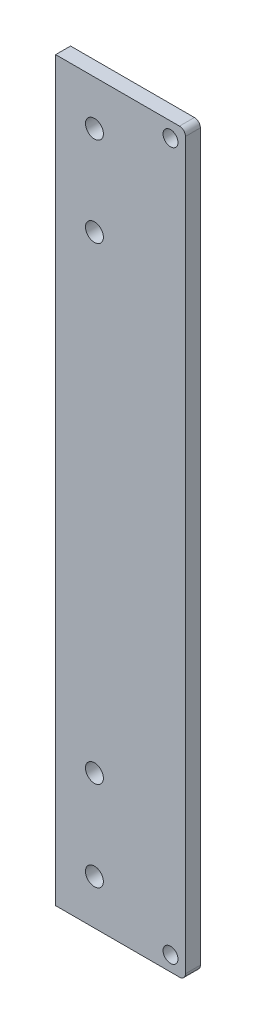
ISO-10303-21;
HEADER;
FILE_DESCRIPTION(('STEP AP214'),'2;1');
FILE_NAME('part.step','',(''),(''),'','','');
FILE_SCHEMA(('AUTOMOTIVE_DESIGN { 1 0 10303 214 1 1 1 1 }'));
ENDSEC;
DATA;
#1=APPLICATION_CONTEXT('core data for automotive mechanical design processes');
#2=APPLICATION_PROTOCOL_DEFINITION('international standard','automotive_design',2000,#1);
#3=PRODUCT_CONTEXT('',#1,'mechanical');
#4=PRODUCT('Part','Part','',(#3));
#5=PRODUCT_RELATED_PRODUCT_CATEGORY('part','',(#4));
#6=PRODUCT_DEFINITION_FORMATION('','',#4);
#7=PRODUCT_DEFINITION_CONTEXT('part definition',#1,'design');
#8=PRODUCT_DEFINITION('design','',#6,#7);
#9=PRODUCT_DEFINITION_SHAPE('','',#8);
#10=(LENGTH_UNIT() NAMED_UNIT(*) SI_UNIT(.MILLI.,.METRE.));
#11=(NAMED_UNIT(*) PLANE_ANGLE_UNIT() SI_UNIT($,.RADIAN.));
#12=(NAMED_UNIT(*) SI_UNIT($,.STERADIAN.) SOLID_ANGLE_UNIT());
#13=UNCERTAINTY_MEASURE_WITH_UNIT(LENGTH_MEASURE(1.E-05),#10,'distance_accuracy_value','');
#14=(GEOMETRIC_REPRESENTATION_CONTEXT(3) GLOBAL_UNCERTAINTY_ASSIGNED_CONTEXT((#13)) GLOBAL_UNIT_ASSIGNED_CONTEXT((#10,
#11,#12)) REPRESENTATION_CONTEXT('',''));
#15=CARTESIAN_POINT('',(0.,0.,0.));
#16=DIRECTION('',(0.,0.,1.));
#17=DIRECTION('',(1.,0.,0.));
#18=AXIS2_PLACEMENT_3D('',#15,#16,#17);
#19=CARTESIAN_POINT('',(-121.5,-121.5,5.));
#20=DIRECTION('',(0.,0.,1.));
#21=DIRECTION('',(1.,0.,0.));
#22=AXIS2_PLACEMENT_3D('',#19,#20,#21);
#23=PLANE('',#22);
#24=CARTESIAN_POINT('',(92.9999999999999,-108.5,5.));
#25=DIRECTION('',(0.,0.,1.));
#26=DIRECTION('',(1.,0.,0.));
#27=AXIS2_PLACEMENT_3D('',#24,#25,#26);
#28=CIRCLE('',#27,3.00000000000001);
#29=CARTESIAN_POINT('',(95.9999999999999,-108.5,5.));
#30=VERTEX_POINT('',#29);
#31=EDGE_CURVE('E108',#30,#30,#28,.T.);
#32=ORIENTED_EDGE('',*,*,#31,.F.);
#33=EDGE_LOOP('',(#32));
#34=FACE_BOUND('',#33,.T.);
#35=CARTESIAN_POINT('',(92.9999999999999,-78.5,5.));
#36=DIRECTION('',(0.,0.,1.));
#37=DIRECTION('',(1.,0.,0.));
#38=AXIS2_PLACEMENT_3D('',#35,#36,#37);
#39=CIRCLE('',#38,3.00000000000001);
#40=CARTESIAN_POINT('',(95.9999999999999,-78.5,5.));
#41=VERTEX_POINT('',#40);
#42=EDGE_CURVE('E158',#41,#41,#39,.T.);
#43=ORIENTED_EDGE('',*,*,#42,.F.);
#44=EDGE_LOOP('',(#43));
#45=FACE_BOUND('',#44,.T.);
#46=CARTESIAN_POINT('',(93.,108.5,5.));
#47=DIRECTION('',(0.,0.,1.));
#48=DIRECTION('',(1.,0.,0.));
#49=AXIS2_PLACEMENT_3D('',#46,#47,#48);
#50=CIRCLE('',#49,3.00000000000001);
#51=CARTESIAN_POINT('',(96.,108.5,5.));
#52=VERTEX_POINT('',#51);
#53=EDGE_CURVE('E161',#52,#52,#50,.T.);
#54=ORIENTED_EDGE('',*,*,#53,.F.);
#55=EDGE_LOOP('',(#54));
#56=FACE_BOUND('',#55,.T.);
#57=CARTESIAN_POINT('',(93.,78.5,5.));
#58=DIRECTION('',(0.,0.,1.));
#59=DIRECTION('',(1.,0.,0.));
#60=AXIS2_PLACEMENT_3D('',#57,#58,#59);
#61=CIRCLE('',#60,3.00000000000001);
#62=CARTESIAN_POINT('',(96.,78.5,5.));
#63=VERTEX_POINT('',#62);
#64=EDGE_CURVE('E164',#63,#63,#61,.T.);
#65=ORIENTED_EDGE('',*,*,#64,.F.);
#66=EDGE_LOOP('',(#65));
#67=FACE_BOUND('',#66,.T.);
#68=DIRECTION('',(0.,1.,0.));
#69=VECTOR('',#68,1.);
#70=CARTESIAN_POINT('',(80.,-121.5,5.));
#71=LINE('',#70,#69);
#72=CARTESIAN_POINT('',(80.,-123.5,5.));
#73=VERTEX_POINT('',#72);
#74=CARTESIAN_POINT('',(80.,123.5,5.));
#75=VERTEX_POINT('',#74);
#76=EDGE_CURVE('E50',#73,#75,#71,.T.);
#77=ORIENTED_EDGE('',*,*,#76,.F.);
#78=DIRECTION('',(1.,0.,0.));
#79=VECTOR('',#78,1.);
#80=CARTESIAN_POINT('',(-121.5,-123.5,5.));
#81=LINE('',#80,#79);
#82=CARTESIAN_POINT('',(121.5,-123.5,5.));
#83=VERTEX_POINT('',#82);
#84=EDGE_CURVE('E85',#73,#83,#81,.T.);
#85=ORIENTED_EDGE('',*,*,#84,.T.);
#86=CARTESIAN_POINT('',(121.5,-121.5,5.));
#87=DIRECTION('',(0.,0.,1.));
#88=DIRECTION('',(1.,0.,0.));
#89=AXIS2_PLACEMENT_3D('',#86,#87,#88);
#90=CIRCLE('',#89,2.);
#91=CARTESIAN_POINT('',(123.5,-121.5,5.));
#92=VERTEX_POINT('',#91);
#93=EDGE_CURVE('E113',#83,#92,#90,.T.);
#94=ORIENTED_EDGE('',*,*,#93,.T.);
#95=DIRECTION('',(0.,1.,0.));
#96=VECTOR('',#95,1.);
#97=CARTESIAN_POINT('',(123.5,-121.5,5.));
#98=LINE('',#97,#96);
#99=CARTESIAN_POINT('',(123.5,121.5,5.));
#100=VERTEX_POINT('',#99);
#101=EDGE_CURVE('E139',#92,#100,#98,.T.);
#102=ORIENTED_EDGE('',*,*,#101,.T.);
#103=CARTESIAN_POINT('',(121.5,121.5,5.));
#104=DIRECTION('',(0.,0.,1.));
#105=DIRECTION('',(1.,0.,0.));
#106=AXIS2_PLACEMENT_3D('',#103,#104,#105);
#107=CIRCLE('',#106,2.);
#108=CARTESIAN_POINT('',(121.5,123.5,5.));
#109=VERTEX_POINT('',#108);
#110=EDGE_CURVE('E58',#100,#109,#107,.T.);
#111=ORIENTED_EDGE('',*,*,#110,.T.);
#112=DIRECTION('',(-1.,0.,0.));
#113=VECTOR('',#112,1.);
#114=CARTESIAN_POINT('',(121.5,123.5,5.));
#115=LINE('',#114,#113);
#116=EDGE_CURVE('E121',#109,#75,#115,.T.);
#117=ORIENTED_EDGE('',*,*,#116,.T.);
#118=EDGE_LOOP('',(#77,#85,#94,#102,#111,#117));
#119=FACE_BOUND('',#118,.T.);
#120=CARTESIAN_POINT('',(118.5,-118.5,5.));
#121=DIRECTION('',(0.,0.,1.));
#122=DIRECTION('',(1.,0.,0.));
#123=AXIS2_PLACEMENT_3D('',#120,#121,#122);
#124=CIRCLE('',#123,2.5);
#125=CARTESIAN_POINT('',(121.,-118.5,5.));
#126=VERTEX_POINT('',#125);
#127=EDGE_CURVE('E145',#126,#126,#124,.T.);
#128=ORIENTED_EDGE('',*,*,#127,.F.);
#129=EDGE_LOOP('',(#128));
#130=FACE_BOUND('',#129,.T.);
#131=CARTESIAN_POINT('',(118.5,118.5,5.));
#132=DIRECTION('',(0.,0.,1.));
#133=DIRECTION('',(-1.,0.,0.));
#134=AXIS2_PLACEMENT_3D('',#131,#132,#133);
#135=CIRCLE('',#134,2.5);
#136=CARTESIAN_POINT('',(116.,118.5,5.));
#137=VERTEX_POINT('',#136);
#138=EDGE_CURVE('E134',#137,#137,#135,.T.);
#139=ORIENTED_EDGE('',*,*,#138,.F.);
#140=EDGE_LOOP('',(#139));
#141=FACE_BOUND('',#140,.T.);
#142=ADVANCED_FACE('F35',(#34,#45,#56,#67,#119,#130,#141),#23,.T.);
#143=CARTESIAN_POINT('',(-121.5,-121.5,0.));
#144=DIRECTION('',(0.,0.,1.));
#145=DIRECTION('',(1.,0.,0.));
#146=AXIS2_PLACEMENT_3D('',#143,#144,#145);
#147=PLANE('',#146);
#148=CARTESIAN_POINT('',(92.9999999999999,-108.5,0.));
#149=DIRECTION('',(0.,0.,-1.));
#150=DIRECTION('',(1.,0.,0.));
#151=AXIS2_PLACEMENT_3D('',#148,#149,#150);
#152=CIRCLE('',#151,3.00000000000001);
#153=CARTESIAN_POINT('',(95.9999999999999,-108.5,0.));
#154=VERTEX_POINT('',#153);
#155=EDGE_CURVE('E171',#154,#154,#152,.T.);
#156=ORIENTED_EDGE('',*,*,#155,.F.);
#157=EDGE_LOOP('',(#156));
#158=FACE_BOUND('',#157,.T.);
#159=CARTESIAN_POINT('',(92.9999999999999,-78.5,0.));
#160=DIRECTION('',(0.,0.,-1.));
#161=DIRECTION('',(1.,0.,0.));
#162=AXIS2_PLACEMENT_3D('',#159,#160,#161);
#163=CIRCLE('',#162,3.00000000000001);
#164=CARTESIAN_POINT('',(95.9999999999999,-78.5,0.));
#165=VERTEX_POINT('',#164);
#166=EDGE_CURVE('E174',#165,#165,#163,.T.);
#167=ORIENTED_EDGE('',*,*,#166,.F.);
#168=EDGE_LOOP('',(#167));
#169=FACE_BOUND('',#168,.T.);
#170=CARTESIAN_POINT('',(93.,108.5,0.));
#171=DIRECTION('',(0.,0.,-1.));
#172=DIRECTION('',(-1.,0.,0.));
#173=AXIS2_PLACEMENT_3D('',#170,#171,#172);
#174=CIRCLE('',#173,3.00000000000001);
#175=CARTESIAN_POINT('',(90.,108.5,0.));
#176=VERTEX_POINT('',#175);
#177=EDGE_CURVE('E170',#176,#176,#174,.T.);
#178=ORIENTED_EDGE('',*,*,#177,.F.);
#179=EDGE_LOOP('',(#178));
#180=FACE_BOUND('',#179,.T.);
#181=CARTESIAN_POINT('',(93.,78.5,0.));
#182=DIRECTION('',(0.,0.,-1.));
#183=DIRECTION('',(-1.,0.,0.));
#184=AXIS2_PLACEMENT_3D('',#181,#182,#183);
#185=CIRCLE('',#184,3.00000000000001);
#186=CARTESIAN_POINT('',(90.,78.5,0.));
#187=VERTEX_POINT('',#186);
#188=EDGE_CURVE('E167',#187,#187,#185,.T.);
#189=ORIENTED_EDGE('',*,*,#188,.F.);
#190=EDGE_LOOP('',(#189));
#191=FACE_BOUND('',#190,.T.);
#192=DIRECTION('',(1.,0.,0.));
#193=VECTOR('',#192,1.);
#194=CARTESIAN_POINT('',(-121.5,-123.5,0.));
#195=LINE('',#194,#193);
#196=CARTESIAN_POINT('',(80.,-123.5,0.));
#197=VERTEX_POINT('',#196);
#198=CARTESIAN_POINT('',(121.5,-123.5,0.));
#199=VERTEX_POINT('',#198);
#200=EDGE_CURVE('E107',#197,#199,#195,.T.);
#201=ORIENTED_EDGE('',*,*,#200,.F.);
#202=DIRECTION('',(0.,-1.,0.));
#203=VECTOR('',#202,1.);
#204=CARTESIAN_POINT('',(80.,-150.,0.));
#205=LINE('',#204,#203);
#206=CARTESIAN_POINT('',(80.,123.5,0.));
#207=VERTEX_POINT('',#206);
#208=EDGE_CURVE('E95',#207,#197,#205,.T.);
#209=ORIENTED_EDGE('',*,*,#208,.F.);
#210=DIRECTION('',(-1.,0.,0.));
#211=VECTOR('',#210,1.);
#212=CARTESIAN_POINT('',(121.5,123.5,0.));
#213=LINE('',#212,#211);
#214=CARTESIAN_POINT('',(121.5,123.5,0.));
#215=VERTEX_POINT('',#214);
#216=EDGE_CURVE('E105',#215,#207,#213,.T.);
#217=ORIENTED_EDGE('',*,*,#216,.F.);
#218=CARTESIAN_POINT('',(121.5,121.5,0.));
#219=DIRECTION('',(0.,0.,1.));
#220=DIRECTION('',(1.,0.,0.));
#221=AXIS2_PLACEMENT_3D('',#218,#219,#220);
#222=CIRCLE('',#221,2.);
#223=CARTESIAN_POINT('',(123.5,121.5,0.));
#224=VERTEX_POINT('',#223);
#225=EDGE_CURVE('E79',#224,#215,#222,.T.);
#226=ORIENTED_EDGE('',*,*,#225,.F.);
#227=DIRECTION('',(0.,1.,0.));
#228=VECTOR('',#227,1.);
#229=CARTESIAN_POINT('',(123.5,-121.5,0.));
#230=LINE('',#229,#228);
#231=CARTESIAN_POINT('',(123.5,-121.5,0.));
#232=VERTEX_POINT('',#231);
#233=EDGE_CURVE('E115',#232,#224,#230,.T.);
#234=ORIENTED_EDGE('',*,*,#233,.F.);
#235=CARTESIAN_POINT('',(121.5,-121.5,0.));
#236=DIRECTION('',(0.,0.,1.));
#237=DIRECTION('',(1.,0.,0.));
#238=AXIS2_PLACEMENT_3D('',#235,#236,#237);
#239=CIRCLE('',#238,2.);
#240=EDGE_CURVE('E130',#199,#232,#239,.T.);
#241=ORIENTED_EDGE('',*,*,#240,.F.);
#242=EDGE_LOOP('',(#201,#209,#217,#226,#234,#241));
#243=FACE_BOUND('',#242,.T.);
#244=CARTESIAN_POINT('',(118.5,118.5,0.));
#245=DIRECTION('',(0.,0.,1.));
#246=DIRECTION('',(-1.,0.,0.));
#247=AXIS2_PLACEMENT_3D('',#244,#245,#246);
#248=CIRCLE('',#247,2.5);
#249=CARTESIAN_POINT('',(116.,118.5,0.));
#250=VERTEX_POINT('',#249);
#251=EDGE_CURVE('E142',#250,#250,#248,.T.);
#252=ORIENTED_EDGE('',*,*,#251,.T.);
#253=EDGE_LOOP('',(#252));
#254=FACE_BOUND('',#253,.T.);
#255=CARTESIAN_POINT('',(118.5,-118.5,0.));
#256=DIRECTION('',(0.,0.,1.));
#257=DIRECTION('',(1.,0.,0.));
#258=AXIS2_PLACEMENT_3D('',#255,#256,#257);
#259=CIRCLE('',#258,2.5);
#260=CARTESIAN_POINT('',(121.,-118.5,0.));
#261=VERTEX_POINT('',#260);
#262=EDGE_CURVE('E148',#261,#261,#259,.T.);
#263=ORIENTED_EDGE('',*,*,#262,.T.);
#264=EDGE_LOOP('',(#263));
#265=FACE_BOUND('',#264,.T.);
#266=ADVANCED_FACE('F103',(#158,#169,#180,#191,#243,#254,#265),#147,.F.);
#267=CARTESIAN_POINT('',(-121.5,-123.5,5.));
#268=DIRECTION('',(0.,1.,0.));
#269=DIRECTION('',(-1.,0.,0.));
#270=AXIS2_PLACEMENT_3D('',#267,#268,#269);
#271=PLANE('',#270);
#272=ORIENTED_EDGE('',*,*,#84,.F.);
#273=DIRECTION('',(0.,0.,-1.));
#274=VECTOR('',#273,1.);
#275=CARTESIAN_POINT('',(80.,-123.5,5.));
#276=LINE('',#275,#274);
#277=EDGE_CURVE('E151',#73,#197,#276,.T.);
#278=ORIENTED_EDGE('',*,*,#277,.T.);
#279=ORIENTED_EDGE('',*,*,#200,.T.);
#280=DIRECTION('',(0.,0.,-1.));
#281=VECTOR('',#280,1.);
#282=CARTESIAN_POINT('',(121.5,-123.5,5.));
#283=LINE('',#282,#281);
#284=EDGE_CURVE('E43',#83,#199,#283,.T.);
#285=ORIENTED_EDGE('',*,*,#284,.F.);
#286=EDGE_LOOP('',(#272,#278,#279,#285));
#287=FACE_BOUND('',#286,.T.);
#288=ADVANCED_FACE('F37',(#287),#271,.F.);
#289=CARTESIAN_POINT('',(121.5,-121.5,5.));
#290=DIRECTION('',(0.,0.,-1.));
#291=DIRECTION('',(-1.,0.,0.));
#292=AXIS2_PLACEMENT_3D('',#289,#290,#291);
#293=CYLINDRICAL_SURFACE('',#292,2.);
#294=ORIENTED_EDGE('',*,*,#240,.T.);
#295=DIRECTION('',(0.,0.,-1.));
#296=VECTOR('',#295,1.);
#297=CARTESIAN_POINT('',(123.5,-121.5,5.));
#298=LINE('',#297,#296);
#299=EDGE_CURVE('E123',#92,#232,#298,.T.);
#300=ORIENTED_EDGE('',*,*,#299,.F.);
#301=ORIENTED_EDGE('',*,*,#93,.F.);
#302=ORIENTED_EDGE('',*,*,#284,.T.);
#303=EDGE_LOOP('',(#294,#300,#301,#302));
#304=FACE_BOUND('',#303,.T.);
#305=ADVANCED_FACE('F128',(#304),#293,.T.);
#306=CARTESIAN_POINT('',(123.5,-121.5,5.));
#307=DIRECTION('',(-1.,0.,0.));
#308=DIRECTION('',(0.,0.,1.));
#309=AXIS2_PLACEMENT_3D('',#306,#307,#308);
#310=PLANE('',#309);
#311=ORIENTED_EDGE('',*,*,#233,.T.);
#312=DIRECTION('',(0.,0.,-1.));
#313=VECTOR('',#312,1.);
#314=CARTESIAN_POINT('',(123.5,121.5,5.));
#315=LINE('',#314,#313);
#316=EDGE_CURVE('E120',#100,#224,#315,.T.);
#317=ORIENTED_EDGE('',*,*,#316,.F.);
#318=ORIENTED_EDGE('',*,*,#101,.F.);
#319=ORIENTED_EDGE('',*,*,#299,.T.);
#320=EDGE_LOOP('',(#311,#317,#318,#319));
#321=FACE_BOUND('',#320,.T.);
#322=ADVANCED_FACE('F219',(#321),#310,.F.);
#323=CARTESIAN_POINT('',(121.5,121.5,5.));
#324=DIRECTION('',(0.,0.,-1.));
#325=DIRECTION('',(-1.,0.,0.));
#326=AXIS2_PLACEMENT_3D('',#323,#324,#325);
#327=CYLINDRICAL_SURFACE('',#326,2.);
#328=ORIENTED_EDGE('',*,*,#225,.T.);
#329=DIRECTION('',(0.,0.,-1.));
#330=VECTOR('',#329,1.);
#331=CARTESIAN_POINT('',(121.5,123.5,5.));
#332=LINE('',#331,#330);
#333=EDGE_CURVE('E111',#109,#215,#332,.T.);
#334=ORIENTED_EDGE('',*,*,#333,.F.);
#335=ORIENTED_EDGE('',*,*,#110,.F.);
#336=ORIENTED_EDGE('',*,*,#316,.T.);
#337=EDGE_LOOP('',(#328,#334,#335,#336));
#338=FACE_BOUND('',#337,.T.);
#339=ADVANCED_FACE('F216',(#338),#327,.T.);
#340=CARTESIAN_POINT('',(121.5,123.5,5.));
#341=DIRECTION('',(0.,-1.,0.));
#342=DIRECTION('',(1.,0.,0.));
#343=AXIS2_PLACEMENT_3D('',#340,#341,#342);
#344=PLANE('',#343);
#345=ORIENTED_EDGE('',*,*,#216,.T.);
#346=DIRECTION('',(0.,0.,1.));
#347=VECTOR('',#346,1.);
#348=CARTESIAN_POINT('',(80.,123.5,5.));
#349=LINE('',#348,#347);
#350=EDGE_CURVE('E11',#207,#75,#349,.T.);
#351=ORIENTED_EDGE('',*,*,#350,.T.);
#352=ORIENTED_EDGE('',*,*,#116,.F.);
#353=ORIENTED_EDGE('',*,*,#333,.T.);
#354=EDGE_LOOP('',(#345,#351,#352,#353));
#355=FACE_BOUND('',#354,.T.);
#356=ADVANCED_FACE('F110',(#355),#344,.F.);
#357=CARTESIAN_POINT('',(118.5,118.5,5.));
#358=DIRECTION('',(0.,0.,-1.));
#359=DIRECTION('',(-1.,0.,0.));
#360=AXIS2_PLACEMENT_3D('',#357,#358,#359);
#361=CYLINDRICAL_SURFACE('',#360,2.5);
#362=ORIENTED_EDGE('',*,*,#138,.T.);
#363=EDGE_LOOP('',(#362));
#364=FACE_BOUND('',#363,.T.);
#365=ORIENTED_EDGE('',*,*,#251,.F.);
#366=EDGE_LOOP('',(#365));
#367=FACE_BOUND('',#366,.T.);
#368=ADVANCED_FACE('F211',(#364,#367),#361,.F.);
#369=CARTESIAN_POINT('',(118.5,-118.5,5.));
#370=DIRECTION('',(0.,0.,-1.));
#371=DIRECTION('',(-1.,0.,0.));
#372=AXIS2_PLACEMENT_3D('',#369,#370,#371);
#373=CYLINDRICAL_SURFACE('',#372,2.5);
#374=ORIENTED_EDGE('',*,*,#127,.T.);
#375=EDGE_LOOP('',(#374));
#376=FACE_BOUND('',#375,.T.);
#377=ORIENTED_EDGE('',*,*,#262,.F.);
#378=EDGE_LOOP('',(#377));
#379=FACE_BOUND('',#378,.T.);
#380=ADVANCED_FACE('F199',(#376,#379),#373,.F.);
#381=CARTESIAN_POINT('',(80.,-150.,10.));
#382=DIRECTION('',(1.,0.,0.));
#383=DIRECTION('',(0.,1.,0.));
#384=AXIS2_PLACEMENT_3D('',#381,#382,#383);
#385=PLANE('',#384);
#386=ORIENTED_EDGE('',*,*,#76,.T.);
#387=ORIENTED_EDGE('',*,*,#350,.F.);
#388=ORIENTED_EDGE('',*,*,#208,.T.);
#389=ORIENTED_EDGE('',*,*,#277,.F.);
#390=EDGE_LOOP('',(#386,#387,#388,#389));
#391=FACE_BOUND('',#390,.T.);
#392=ADVANCED_FACE('F94',(#391),#385,.F.);
#393=CARTESIAN_POINT('',(93.,78.5,10.));
#394=DIRECTION('',(0.,0.,-1.));
#395=DIRECTION('',(-1.,0.,0.));
#396=AXIS2_PLACEMENT_3D('',#393,#394,#395);
#397=CYLINDRICAL_SURFACE('',#396,3.00000000000001);
#398=ORIENTED_EDGE('',*,*,#64,.T.);
#399=EDGE_LOOP('',(#398));
#400=FACE_BOUND('',#399,.T.);
#401=ORIENTED_EDGE('',*,*,#188,.T.);
#402=EDGE_LOOP('',(#401));
#403=FACE_BOUND('',#402,.T.);
#404=ADVANCED_FACE('F188',(#400,#403),#397,.F.);
#405=CARTESIAN_POINT('',(93.,108.5,10.));
#406=DIRECTION('',(0.,0.,-1.));
#407=DIRECTION('',(-1.,0.,0.));
#408=AXIS2_PLACEMENT_3D('',#405,#406,#407);
#409=CYLINDRICAL_SURFACE('',#408,3.00000000000001);
#410=ORIENTED_EDGE('',*,*,#53,.T.);
#411=EDGE_LOOP('',(#410));
#412=FACE_BOUND('',#411,.T.);
#413=ORIENTED_EDGE('',*,*,#177,.T.);
#414=EDGE_LOOP('',(#413));
#415=FACE_BOUND('',#414,.T.);
#416=ADVANCED_FACE('F180',(#412,#415),#409,.F.);
#417=CARTESIAN_POINT('',(92.9999999999999,-78.5,10.));
#418=DIRECTION('',(0.,0.,-1.));
#419=DIRECTION('',(-1.,0.,0.));
#420=AXIS2_PLACEMENT_3D('',#417,#418,#419);
#421=CYLINDRICAL_SURFACE('',#420,3.00000000000001);
#422=ORIENTED_EDGE('',*,*,#42,.T.);
#423=EDGE_LOOP('',(#422));
#424=FACE_BOUND('',#423,.T.);
#425=ORIENTED_EDGE('',*,*,#166,.T.);
#426=EDGE_LOOP('',(#425));
#427=FACE_BOUND('',#426,.T.);
#428=ADVANCED_FACE('F196',(#424,#427),#421,.F.);
#429=CARTESIAN_POINT('',(92.9999999999999,-108.5,10.));
#430=DIRECTION('',(0.,0.,-1.));
#431=DIRECTION('',(-1.,0.,0.));
#432=AXIS2_PLACEMENT_3D('',#429,#430,#431);
#433=CYLINDRICAL_SURFACE('',#432,3.00000000000001);
#434=ORIENTED_EDGE('',*,*,#31,.T.);
#435=EDGE_LOOP('',(#434));
#436=FACE_BOUND('',#435,.T.);
#437=ORIENTED_EDGE('',*,*,#155,.T.);
#438=EDGE_LOOP('',(#437));
#439=FACE_BOUND('',#438,.T.);
#440=ADVANCED_FACE('F302',(#436,#439),#433,.F.);
#441=CLOSED_SHELL('',(#142,#266,#288,#305,#322,#339,#356,#368,#380,#392,#404,#416,#428,#440));
#442=MANIFOLD_SOLID_BREP('B2',#441);
#443=ADVANCED_BREP_SHAPE_REPRESENTATION('',(#18,#442),#14);
#444=SHAPE_DEFINITION_REPRESENTATION(#9,#443);
ENDSEC;
END-ISO-10303-21;
